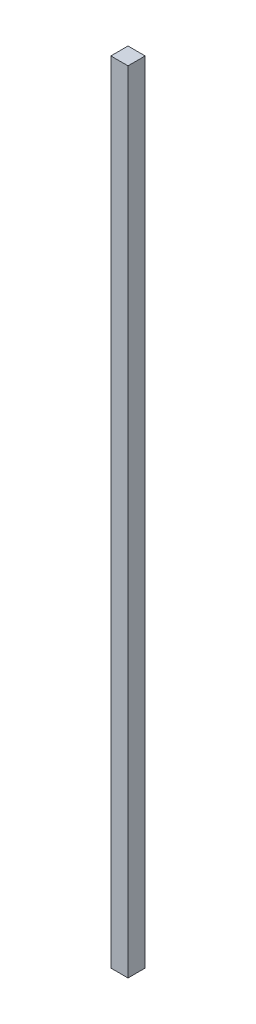
ISO-10303-21;
HEADER;
FILE_DESCRIPTION(('STEP AP214'),'2;1');
FILE_NAME('part.step','',(''),(''),'','','');
FILE_SCHEMA(('AUTOMOTIVE_DESIGN { 1 0 10303 214 1 1 1 1 }'));
ENDSEC;
DATA;
#1=APPLICATION_CONTEXT('core data for automotive mechanical design processes');
#2=APPLICATION_PROTOCOL_DEFINITION('international standard','automotive_design',2000,#1);
#3=PRODUCT_CONTEXT('',#1,'mechanical');
#4=PRODUCT('Part','Part','',(#3));
#5=PRODUCT_RELATED_PRODUCT_CATEGORY('part','',(#4));
#6=PRODUCT_DEFINITION_FORMATION('','',#4);
#7=PRODUCT_DEFINITION_CONTEXT('part definition',#1,'design');
#8=PRODUCT_DEFINITION('design','',#6,#7);
#9=PRODUCT_DEFINITION_SHAPE('','',#8);
#10=(LENGTH_UNIT() NAMED_UNIT(*) SI_UNIT(.MILLI.,.METRE.));
#11=(NAMED_UNIT(*) PLANE_ANGLE_UNIT() SI_UNIT($,.RADIAN.));
#12=(NAMED_UNIT(*) SI_UNIT($,.STERADIAN.) SOLID_ANGLE_UNIT());
#13=UNCERTAINTY_MEASURE_WITH_UNIT(LENGTH_MEASURE(1.E-05),#10,'distance_accuracy_value','');
#14=(GEOMETRIC_REPRESENTATION_CONTEXT(3) GLOBAL_UNCERTAINTY_ASSIGNED_CONTEXT((#13)) GLOBAL_UNIT_ASSIGNED_CONTEXT((#10,
#11,#12)) REPRESENTATION_CONTEXT('',''));
#15=CARTESIAN_POINT('',(0.,0.,0.));
#16=DIRECTION('',(0.,0.,1.));
#17=DIRECTION('',(1.,0.,0.));
#18=AXIS2_PLACEMENT_3D('',#15,#16,#17);
#19=CARTESIAN_POINT('',(-40.4476033834586,31.9642857142857,10.));
#20=DIRECTION('',(1.,0.,0.));
#21=DIRECTION('',(0.,1.,0.));
#22=AXIS2_PLACEMENT_3D('',#19,#20,#21);
#23=PLANE('',#22);
#24=DIRECTION('',(0.,-1.,0.));
#25=VECTOR('',#24,1.);
#26=CARTESIAN_POINT('',(-40.4476033834586,31.9642857142857,0.));
#27=LINE('',#26,#25);
#28=CARTESIAN_POINT('',(-40.4476033834586,31.9642857142857,0.));
#29=VERTEX_POINT('',#28);
#30=CARTESIAN_POINT('',(-40.4476033834586,-428.035714285714,0.));
#31=VERTEX_POINT('',#30);
#32=EDGE_CURVE('E96',#29,#31,#27,.T.);
#33=ORIENTED_EDGE('',*,*,#32,.T.);
#34=DIRECTION('',(0.,0.,-1.));
#35=VECTOR('',#34,1.);
#36=CARTESIAN_POINT('',(-40.4476033834586,-428.035714285714,10.));
#37=LINE('',#36,#35);
#38=CARTESIAN_POINT('',(-40.4476033834586,-428.035714285714,10.));
#39=VERTEX_POINT('',#38);
#40=EDGE_CURVE('E11',#39,#31,#37,.T.);
#41=ORIENTED_EDGE('',*,*,#40,.F.);
#42=DIRECTION('',(0.,-1.,0.));
#43=VECTOR('',#42,1.);
#44=CARTESIAN_POINT('',(-40.4476033834586,31.9642857142857,10.));
#45=LINE('',#44,#43);
#46=CARTESIAN_POINT('',(-40.4476033834586,31.9642857142857,10.));
#47=VERTEX_POINT('',#46);
#48=EDGE_CURVE('E84',#47,#39,#45,.T.);
#49=ORIENTED_EDGE('',*,*,#48,.F.);
#50=DIRECTION('',(0.,0.,-1.));
#51=VECTOR('',#50,1.);
#52=CARTESIAN_POINT('',(-40.4476033834586,31.9642857142857,10.));
#53=LINE('',#52,#51);
#54=EDGE_CURVE('E92',#47,#29,#53,.T.);
#55=ORIENTED_EDGE('',*,*,#54,.T.);
#56=EDGE_LOOP('',(#33,#41,#49,#55));
#57=FACE_BOUND('',#56,.T.);
#58=ADVANCED_FACE('F33',(#57),#23,.F.);
#59=CARTESIAN_POINT('',(-40.4476033834586,-428.035714285714,10.));
#60=DIRECTION('',(0.,1.,0.));
#61=DIRECTION('',(0.,0.,1.));
#62=AXIS2_PLACEMENT_3D('',#59,#60,#61);
#63=PLANE('',#62);
#64=DIRECTION('',(1.,0.,0.));
#65=VECTOR('',#64,1.);
#66=CARTESIAN_POINT('',(-40.4476033834586,-428.035714285714,0.));
#67=LINE('',#66,#65);
#68=CARTESIAN_POINT('',(-30.4476033834586,-428.035714285714,0.));
#69=VERTEX_POINT('',#68);
#70=EDGE_CURVE('E88',#31,#69,#67,.T.);
#71=ORIENTED_EDGE('',*,*,#70,.T.);
#72=DIRECTION('',(0.,0.,-1.));
#73=VECTOR('',#72,1.);
#74=CARTESIAN_POINT('',(-30.4476033834586,-428.035714285714,10.));
#75=LINE('',#74,#73);
#76=CARTESIAN_POINT('',(-30.4476033834586,-428.035714285714,10.));
#77=VERTEX_POINT('',#76);
#78=EDGE_CURVE('E41',#77,#69,#75,.T.);
#79=ORIENTED_EDGE('',*,*,#78,.F.);
#80=DIRECTION('',(1.,0.,0.));
#81=VECTOR('',#80,1.);
#82=CARTESIAN_POINT('',(-40.4476033834586,-428.035714285714,10.));
#83=LINE('',#82,#81);
#84=EDGE_CURVE('E79',#39,#77,#83,.T.);
#85=ORIENTED_EDGE('',*,*,#84,.F.);
#86=ORIENTED_EDGE('',*,*,#40,.T.);
#87=EDGE_LOOP('',(#71,#79,#85,#86));
#88=FACE_BOUND('',#87,.T.);
#89=ADVANCED_FACE('F87',(#88),#63,.F.);
#90=CARTESIAN_POINT('',(-30.4476033834586,31.9642857142857,10.));
#91=DIRECTION('',(-1.,0.,0.));
#92=DIRECTION('',(0.,-1.,0.));
#93=AXIS2_PLACEMENT_3D('',#90,#91,#92);
#94=PLANE('',#93);
#95=DIRECTION('',(0.,1.,0.));
#96=VECTOR('',#95,1.);
#97=CARTESIAN_POINT('',(-30.4476033834586,31.9642857142857,0.));
#98=LINE('',#97,#96);
#99=CARTESIAN_POINT('',(-30.4476033834586,31.9642857142857,0.));
#100=VERTEX_POINT('',#99);
#101=EDGE_CURVE('E66',#69,#100,#98,.T.);
#102=ORIENTED_EDGE('',*,*,#101,.T.);
#103=DIRECTION('',(0.,0.,-1.));
#104=VECTOR('',#103,1.);
#105=CARTESIAN_POINT('',(-30.4476033834586,31.9642857142857,10.));
#106=LINE('',#105,#104);
#107=CARTESIAN_POINT('',(-30.4476033834586,31.9642857142857,10.));
#108=VERTEX_POINT('',#107);
#109=EDGE_CURVE('E89',#108,#100,#106,.T.);
#110=ORIENTED_EDGE('',*,*,#109,.F.);
#111=DIRECTION('',(0.,1.,0.));
#112=VECTOR('',#111,1.);
#113=CARTESIAN_POINT('',(-30.4476033834586,31.9642857142857,10.));
#114=LINE('',#113,#112);
#115=EDGE_CURVE('E82',#77,#108,#114,.T.);
#116=ORIENTED_EDGE('',*,*,#115,.F.);
#117=ORIENTED_EDGE('',*,*,#78,.T.);
#118=EDGE_LOOP('',(#102,#110,#116,#117));
#119=FACE_BOUND('',#118,.T.);
#120=ADVANCED_FACE('F90',(#119),#94,.F.);
#121=CARTESIAN_POINT('',(-40.4476033834586,31.9642857142857,10.));
#122=DIRECTION('',(0.,-1.,0.));
#123=DIRECTION('',(0.,0.,-1.));
#124=AXIS2_PLACEMENT_3D('',#121,#122,#123);
#125=PLANE('',#124);
#126=DIRECTION('',(-1.,0.,0.));
#127=VECTOR('',#126,1.);
#128=CARTESIAN_POINT('',(-40.4476033834586,31.9642857142857,0.));
#129=LINE('',#128,#127);
#130=EDGE_CURVE('E72',#100,#29,#129,.T.);
#131=ORIENTED_EDGE('',*,*,#130,.T.);
#132=ORIENTED_EDGE('',*,*,#54,.F.);
#133=DIRECTION('',(-1.,0.,0.));
#134=VECTOR('',#133,1.);
#135=CARTESIAN_POINT('',(-40.4476033834586,31.9642857142857,10.));
#136=LINE('',#135,#134);
#137=EDGE_CURVE('E49',#108,#47,#136,.T.);
#138=ORIENTED_EDGE('',*,*,#137,.F.);
#139=ORIENTED_EDGE('',*,*,#109,.T.);
#140=EDGE_LOOP('',(#131,#132,#138,#139));
#141=FACE_BOUND('',#140,.T.);
#142=ADVANCED_FACE('F103',(#141),#125,.F.);
#143=CARTESIAN_POINT('',(0.,0.,10.));
#144=DIRECTION('',(0.,0.,1.));
#145=DIRECTION('',(1.,0.,0.));
#146=AXIS2_PLACEMENT_3D('',#143,#144,#145);
#147=PLANE('',#146);
#148=ORIENTED_EDGE('',*,*,#48,.T.);
#149=ORIENTED_EDGE('',*,*,#84,.T.);
#150=ORIENTED_EDGE('',*,*,#115,.T.);
#151=ORIENTED_EDGE('',*,*,#137,.T.);
#152=EDGE_LOOP('',(#148,#149,#150,#151));
#153=FACE_BOUND('',#152,.T.);
#154=ADVANCED_FACE('F80',(#153),#147,.T.);
#155=CARTESIAN_POINT('',(0.,0.,0.));
#156=DIRECTION('',(0.,0.,1.));
#157=DIRECTION('',(1.,0.,0.));
#158=AXIS2_PLACEMENT_3D('',#155,#156,#157);
#159=PLANE('',#158);
#160=ORIENTED_EDGE('',*,*,#32,.F.);
#161=ORIENTED_EDGE('',*,*,#130,.F.);
#162=ORIENTED_EDGE('',*,*,#101,.F.);
#163=ORIENTED_EDGE('',*,*,#70,.F.);
#164=EDGE_LOOP('',(#160,#161,#162,#163));
#165=FACE_BOUND('',#164,.T.);
#166=ADVANCED_FACE('F106',(#165),#159,.F.);
#167=CLOSED_SHELL('',(#58,#89,#120,#142,#154,#166));
#168=MANIFOLD_SOLID_BREP('B2',#167);
#169=ADVANCED_BREP_SHAPE_REPRESENTATION('',(#18,#168),#14);
#170=SHAPE_DEFINITION_REPRESENTATION(#9,#169);
ENDSEC;
END-ISO-10303-21;
